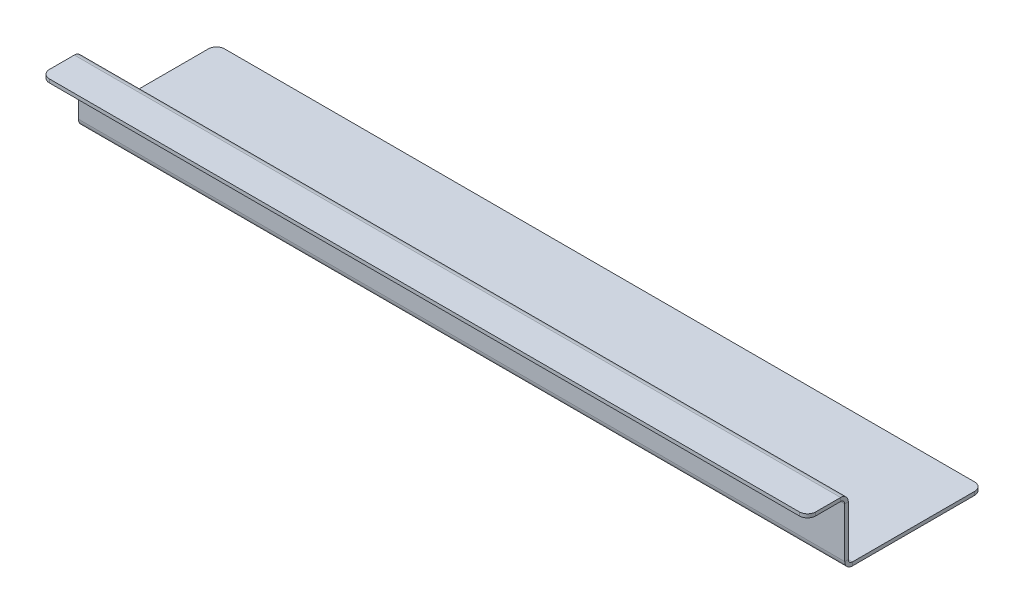
ISO-10303-21;
HEADER;
FILE_DESCRIPTION(('STEP AP214'),'2;1');
FILE_NAME('part.step','',(''),(''),'','','');
FILE_SCHEMA(('AUTOMOTIVE_DESIGN { 1 0 10303 214 1 1 1 1 }'));
ENDSEC;
DATA;
#1=APPLICATION_CONTEXT('core data for automotive mechanical design processes');
#2=APPLICATION_PROTOCOL_DEFINITION('international standard','automotive_design',2000,#1);
#3=PRODUCT_CONTEXT('',#1,'mechanical');
#4=PRODUCT('Part','Part','',(#3));
#5=PRODUCT_RELATED_PRODUCT_CATEGORY('part','',(#4));
#6=PRODUCT_DEFINITION_FORMATION('','',#4);
#7=PRODUCT_DEFINITION_CONTEXT('part definition',#1,'design');
#8=PRODUCT_DEFINITION('design','',#6,#7);
#9=PRODUCT_DEFINITION_SHAPE('','',#8);
#10=(LENGTH_UNIT() NAMED_UNIT(*) SI_UNIT(.MILLI.,.METRE.));
#11=(NAMED_UNIT(*) PLANE_ANGLE_UNIT() SI_UNIT($,.RADIAN.));
#12=(NAMED_UNIT(*) SI_UNIT($,.STERADIAN.) SOLID_ANGLE_UNIT());
#13=UNCERTAINTY_MEASURE_WITH_UNIT(LENGTH_MEASURE(1.E-05),#10,'distance_accuracy_value','');
#14=(GEOMETRIC_REPRESENTATION_CONTEXT(3) GLOBAL_UNCERTAINTY_ASSIGNED_CONTEXT((#13)) GLOBAL_UNIT_ASSIGNED_CONTEXT((#10,
#11,#12)) REPRESENTATION_CONTEXT('',''));
#15=CARTESIAN_POINT('',(0.,0.,0.));
#16=DIRECTION('',(0.,0.,1.));
#17=DIRECTION('',(1.,0.,0.));
#18=AXIS2_PLACEMENT_3D('',#15,#16,#17);
#19=CARTESIAN_POINT('',(596.9,-50.8,-31.7500000000002));
#20=DIRECTION('',(-1.,0.,0.));
#21=DIRECTION('',(0.,0.,1.));
#22=AXIS2_PLACEMENT_3D('',#19,#20,#21);
#23=PLANE('',#22);
#24=DIRECTION('',(0.,0.,1.));
#25=VECTOR('',#24,1.);
#26=CARTESIAN_POINT('',(596.9,-44.87164,-31.7500000000001));
#27=LINE('',#26,#25);
#28=CARTESIAN_POINT('',(596.9,-44.87164,-31.7500000000001));
#29=VERTEX_POINT('',#28);
#30=CARTESIAN_POINT('',(596.9,-44.87164,-28.9966400000001));
#31=VERTEX_POINT('',#30);
#32=EDGE_CURVE('E249',#29,#31,#27,.T.);
#33=ORIENTED_EDGE('',*,*,#32,.F.);
#34=DIRECTION('',(0.,-1.,0.));
#35=VECTOR('',#34,1.);
#36=CARTESIAN_POINT('',(596.9,1.19661315799875E-13,-31.75));
#37=LINE('',#36,#35);
#38=CARTESIAN_POINT('',(596.9,-5.92835999999999,-31.75));
#39=VERTEX_POINT('',#38);
#40=EDGE_CURVE('E257',#39,#29,#37,.T.);
#41=ORIENTED_EDGE('',*,*,#40,.F.);
#42=DIRECTION('',(0.,0.,1.));
#43=VECTOR('',#42,1.);
#44=CARTESIAN_POINT('',(596.9,-5.92836000000001,-28.99664));
#45=LINE('',#44,#43);
#46=CARTESIAN_POINT('',(596.9,-5.92836000000005,-28.99664));
#47=VERTEX_POINT('',#46);
#48=EDGE_CURVE('E268',#47,#39,#45,.F.);
#49=ORIENTED_EDGE('',*,*,#48,.F.);
#50=DIRECTION('',(0.,1.,0.));
#51=VECTOR('',#50,1.);
#52=CARTESIAN_POINT('',(596.9,-50.8,-28.9966400000002));
#53=LINE('',#52,#51);
#54=EDGE_CURVE('E262',#47,#31,#53,.F.);
#55=ORIENTED_EDGE('',*,*,#54,.T.);
#56=EDGE_LOOP('',(#33,#41,#49,#55));
#57=FACE_BOUND('',#56,.T.);
#58=ADVANCED_FACE('F80',(#57),#23,.F.);
#59=CARTESIAN_POINT('',(0.,-2.75335999999999,-31.75));
#60=DIRECTION('',(1.,0.,0.));
#61=DIRECTION('',(0.,0.,-1.));
#62=AXIS2_PLACEMENT_3D('',#59,#60,#61);
#63=PLANE('',#62);
#64=DIRECTION('',(0.,0.,1.));
#65=VECTOR('',#64,1.);
#66=CARTESIAN_POINT('',(0.,-44.87164,-31.7500000000001));
#67=LINE('',#66,#65);
#68=CARTESIAN_POINT('',(0.,-44.87164,-31.7500000000001));
#69=VERTEX_POINT('',#68);
#70=CARTESIAN_POINT('',(0.,-44.87164,-28.9966400000001));
#71=VERTEX_POINT('',#70);
#72=EDGE_CURVE('E242',#69,#71,#67,.T.);
#73=ORIENTED_EDGE('',*,*,#72,.T.);
#74=DIRECTION('',(0.,-1.,0.));
#75=VECTOR('',#74,1.);
#76=CARTESIAN_POINT('',(0.,-2.75336,-28.99664));
#77=LINE('',#76,#75);
#78=CARTESIAN_POINT('',(0.,-5.92835999999997,-28.99664));
#79=VERTEX_POINT('',#78);
#80=EDGE_CURVE('E260',#71,#79,#77,.F.);
#81=ORIENTED_EDGE('',*,*,#80,.T.);
#82=DIRECTION('',(0.,0.,1.));
#83=VECTOR('',#82,1.);
#84=CARTESIAN_POINT('',(0.,-5.92835999999997,-31.75));
#85=LINE('',#84,#83);
#86=CARTESIAN_POINT('',(0.,-5.92835999999996,-31.75));
#87=VERTEX_POINT('',#86);
#88=EDGE_CURVE('E252',#79,#87,#85,.F.);
#89=ORIENTED_EDGE('',*,*,#88,.T.);
#90=DIRECTION('',(0.,1.,0.));
#91=VECTOR('',#90,1.);
#92=CARTESIAN_POINT('',(0.,1.19661315799875E-13,-31.75));
#93=LINE('',#92,#91);
#94=EDGE_CURVE('E254',#69,#87,#93,.T.);
#95=ORIENTED_EDGE('',*,*,#94,.F.);
#96=EDGE_LOOP('',(#73,#81,#89,#95));
#97=FACE_BOUND('',#96,.T.);
#98=ADVANCED_FACE('F382',(#97),#63,.F.);
#99=CARTESIAN_POINT('',(0.,1.19661315799875E-13,-31.75));
#100=DIRECTION('',(0.,0.,1.));
#101=DIRECTION('',(0.,-1.,0.));
#102=AXIS2_PLACEMENT_3D('',#99,#100,#101);
#103=PLANE('',#102);
#104=DIRECTION('',(-1.,0.,0.));
#105=VECTOR('',#104,1.);
#106=CARTESIAN_POINT('',(0.,-44.87164,-31.7500000000001));
#107=LINE('',#106,#105);
#108=EDGE_CURVE('E246',#69,#29,#107,.F.);
#109=ORIENTED_EDGE('',*,*,#108,.F.);
#110=ORIENTED_EDGE('',*,*,#94,.T.);
#111=DIRECTION('',(1.,0.,0.));
#112=VECTOR('',#111,1.);
#113=CARTESIAN_POINT('',(0.,-5.92835999999997,-31.75));
#114=LINE('',#113,#112);
#115=EDGE_CURVE('E265',#39,#87,#114,.F.);
#116=ORIENTED_EDGE('',*,*,#115,.F.);
#117=ORIENTED_EDGE('',*,*,#40,.T.);
#118=EDGE_LOOP('',(#109,#110,#116,#117));
#119=FACE_BOUND('',#118,.T.);
#120=ADVANCED_FACE('F371',(#119),#103,.F.);
#121=CARTESIAN_POINT('',(0.,1.10048010740757E-13,-28.99664));
#122=DIRECTION('',(0.,0.,1.));
#123=DIRECTION('',(0.,-1.,0.));
#124=AXIS2_PLACEMENT_3D('',#121,#122,#123);
#125=PLANE('',#124);
#126=ORIENTED_EDGE('',*,*,#80,.F.);
#127=DIRECTION('',(-1.,0.,0.));
#128=VECTOR('',#127,1.);
#129=CARTESIAN_POINT('',(0.,-44.87164,-28.9966400000001));
#130=LINE('',#129,#128);
#131=EDGE_CURVE('E203',#71,#31,#130,.F.);
#132=ORIENTED_EDGE('',*,*,#131,.T.);
#133=ORIENTED_EDGE('',*,*,#54,.F.);
#134=DIRECTION('',(1.,0.,0.));
#135=VECTOR('',#134,1.);
#136=CARTESIAN_POINT('',(0.,-5.92835999999999,-28.99664));
#137=LINE('',#136,#135);
#138=EDGE_CURVE('E271',#79,#47,#137,.T.);
#139=ORIENTED_EDGE('',*,*,#138,.F.);
#140=EDGE_LOOP('',(#126,#132,#133,#139));
#141=FACE_BOUND('',#140,.T.);
#142=ADVANCED_FACE('F386',(#141),#125,.T.);
#143=CARTESIAN_POINT('',(596.9,-2.75336,0.));
#144=DIRECTION('',(1.,0.,0.));
#145=DIRECTION('',(0.,0.,-1.));
#146=AXIS2_PLACEMENT_3D('',#143,#144,#145);
#147=PLANE('',#146);
#148=DIRECTION('',(0.,0.,-1.));
#149=VECTOR('',#148,1.);
#150=CARTESIAN_POINT('',(596.9,0.,0.));
#151=LINE('',#150,#149);
#152=CARTESIAN_POINT('',(596.9,0.,-6.35));
#153=VERTEX_POINT('',#152);
#154=CARTESIAN_POINT('',(596.9,0.,-25.82164));
#155=VERTEX_POINT('',#154);
#156=EDGE_CURVE('E302',#153,#155,#151,.T.);
#157=ORIENTED_EDGE('',*,*,#156,.F.);
#158=DIRECTION('',(0.,1.,0.));
#159=VECTOR('',#158,1.);
#160=CARTESIAN_POINT('',(596.9,-2.75336,-6.35));
#161=LINE('',#160,#159);
#162=CARTESIAN_POINT('',(596.9,-2.75336,-6.35));
#163=VERTEX_POINT('',#162);
#164=EDGE_CURVE('E322',#153,#163,#161,.F.);
#165=ORIENTED_EDGE('',*,*,#164,.T.);
#166=DIRECTION('',(0.,0.,-1.));
#167=VECTOR('',#166,1.);
#168=CARTESIAN_POINT('',(596.9,-2.75336,0.));
#169=LINE('',#168,#167);
#170=CARTESIAN_POINT('',(596.9,-2.75336,-25.82164));
#171=VERTEX_POINT('',#170);
#172=EDGE_CURVE('E305',#163,#171,#169,.T.);
#173=ORIENTED_EDGE('',*,*,#172,.T.);
#174=DIRECTION('',(0.,1.,0.));
#175=VECTOR('',#174,1.);
#176=CARTESIAN_POINT('',(596.9,-2.75336000000006,-25.82164));
#177=LINE('',#176,#175);
#178=EDGE_CURVE('E281',#171,#155,#177,.T.);
#179=ORIENTED_EDGE('',*,*,#178,.T.);
#180=EDGE_LOOP('',(#157,#165,#173,#179));
#181=FACE_BOUND('',#180,.T.);
#182=ADVANCED_FACE('F395',(#181),#147,.T.);
#183=CARTESIAN_POINT('',(0.,-2.75336,0.));
#184=DIRECTION('',(0.,-1.,0.));
#185=DIRECTION('',(0.,0.,-1.));
#186=AXIS2_PLACEMENT_3D('',#183,#184,#185);
#187=PLANE('',#186);
#188=ORIENTED_EDGE('',*,*,#172,.F.);
#189=CARTESIAN_POINT('',(590.55,-2.75336,-6.35));
#190=DIRECTION('',(0.,-1.,0.));
#191=DIRECTION('',(0.,0.,-1.));
#192=AXIS2_PLACEMENT_3D('',#189,#190,#191);
#193=CIRCLE('',#192,6.35);
#194=CARTESIAN_POINT('',(590.55,-2.75336,0.));
#195=VERTEX_POINT('',#194);
#196=EDGE_CURVE('E326',#163,#195,#193,.T.);
#197=ORIENTED_EDGE('',*,*,#196,.T.);
#198=DIRECTION('',(1.,0.,0.));
#199=VECTOR('',#198,1.);
#200=CARTESIAN_POINT('',(0.,-2.75336,0.));
#201=LINE('',#200,#199);
#202=CARTESIAN_POINT('',(6.35,-2.75336,0.));
#203=VERTEX_POINT('',#202);
#204=EDGE_CURVE('E301',#203,#195,#201,.T.);
#205=ORIENTED_EDGE('',*,*,#204,.F.);
#206=CARTESIAN_POINT('',(6.35,-2.75336,-6.35));
#207=DIRECTION('',(0.,-1.,0.));
#208=DIRECTION('',(0.,0.,-1.));
#209=AXIS2_PLACEMENT_3D('',#206,#207,#208);
#210=CIRCLE('',#209,6.35);
#211=CARTESIAN_POINT('',(0.,-2.75336,-6.35));
#212=VERTEX_POINT('',#211);
#213=EDGE_CURVE('E324',#203,#212,#210,.T.);
#214=ORIENTED_EDGE('',*,*,#213,.T.);
#215=DIRECTION('',(0.,0.,1.));
#216=VECTOR('',#215,1.);
#217=CARTESIAN_POINT('',(0.,-2.75336,0.));
#218=LINE('',#217,#216);
#219=CARTESIAN_POINT('',(0.,-2.75336,-25.82164));
#220=VERTEX_POINT('',#219);
#221=EDGE_CURVE('E298',#220,#212,#218,.T.);
#222=ORIENTED_EDGE('',*,*,#221,.F.);
#223=DIRECTION('',(1.,0.,0.));
#224=VECTOR('',#223,1.);
#225=CARTESIAN_POINT('',(596.9,-2.75336000000006,-25.82164));
#226=LINE('',#225,#224);
#227=EDGE_CURVE('E287',#171,#220,#226,.F.);
#228=ORIENTED_EDGE('',*,*,#227,.F.);
#229=EDGE_LOOP('',(#188,#197,#205,#214,#222,#228));
#230=FACE_BOUND('',#229,.T.);
#231=ADVANCED_FACE('F418',(#230),#187,.T.);
#232=CARTESIAN_POINT('',(0.,0.,0.));
#233=DIRECTION('',(0.,-1.,0.));
#234=DIRECTION('',(0.,0.,-1.));
#235=AXIS2_PLACEMENT_3D('',#232,#233,#234);
#236=PLANE('',#235);
#237=DIRECTION('',(1.,0.,0.));
#238=VECTOR('',#237,1.);
#239=CARTESIAN_POINT('',(0.,0.,0.));
#240=LINE('',#239,#238);
#241=CARTESIAN_POINT('',(6.35,0.,0.));
#242=VERTEX_POINT('',#241);
#243=CARTESIAN_POINT('',(590.55,0.,0.));
#244=VERTEX_POINT('',#243);
#245=EDGE_CURVE('E310',#242,#244,#240,.T.);
#246=ORIENTED_EDGE('',*,*,#245,.T.);
#247=CARTESIAN_POINT('',(590.55,0.,-6.35));
#248=DIRECTION('',(0.,-1.,0.));
#249=DIRECTION('',(0.,0.,-1.));
#250=AXIS2_PLACEMENT_3D('',#247,#248,#249);
#251=CIRCLE('',#250,6.35);
#252=EDGE_CURVE('E320',#244,#153,#251,.F.);
#253=ORIENTED_EDGE('',*,*,#252,.T.);
#254=ORIENTED_EDGE('',*,*,#156,.T.);
#255=DIRECTION('',(1.,0.,0.));
#256=VECTOR('',#255,1.);
#257=CARTESIAN_POINT('',(596.9,0.,-25.82164));
#258=LINE('',#257,#256);
#259=CARTESIAN_POINT('',(0.,0.,-25.82164));
#260=VERTEX_POINT('',#259);
#261=EDGE_CURVE('E275',#155,#260,#258,.F.);
#262=ORIENTED_EDGE('',*,*,#261,.T.);
#263=DIRECTION('',(0.,0.,1.));
#264=VECTOR('',#263,1.);
#265=CARTESIAN_POINT('',(0.,0.,0.));
#266=LINE('',#265,#264);
#267=CARTESIAN_POINT('',(0.,0.,-6.35));
#268=VERTEX_POINT('',#267);
#269=EDGE_CURVE('E295',#260,#268,#266,.T.);
#270=ORIENTED_EDGE('',*,*,#269,.T.);
#271=CARTESIAN_POINT('',(6.35,0.,-6.35));
#272=DIRECTION('',(0.,-1.,0.));
#273=DIRECTION('',(0.,0.,-1.));
#274=AXIS2_PLACEMENT_3D('',#271,#272,#273);
#275=CIRCLE('',#274,6.35);
#276=EDGE_CURVE('E318',#268,#242,#275,.F.);
#277=ORIENTED_EDGE('',*,*,#276,.T.);
#278=EDGE_LOOP('',(#246,#253,#254,#262,#270,#277));
#279=FACE_BOUND('',#278,.T.);
#280=ADVANCED_FACE('F401',(#279),#236,.F.);
#281=CARTESIAN_POINT('',(0.,-2.75336,0.));
#282=DIRECTION('',(-1.,0.,0.));
#283=DIRECTION('',(0.,0.,1.));
#284=AXIS2_PLACEMENT_3D('',#281,#282,#283);
#285=PLANE('',#284);
#286=ORIENTED_EDGE('',*,*,#221,.T.);
#287=DIRECTION('',(0.,1.,0.));
#288=VECTOR('',#287,1.);
#289=CARTESIAN_POINT('',(0.,-2.75336,-6.35));
#290=LINE('',#289,#288);
#291=EDGE_CURVE('E13',#212,#268,#290,.T.);
#292=ORIENTED_EDGE('',*,*,#291,.T.);
#293=ORIENTED_EDGE('',*,*,#269,.F.);
#294=DIRECTION('',(0.,1.,0.));
#295=VECTOR('',#294,1.);
#296=CARTESIAN_POINT('',(0.,-2.75335999999998,-25.82164));
#297=LINE('',#296,#295);
#298=EDGE_CURVE('E292',#220,#260,#297,.T.);
#299=ORIENTED_EDGE('',*,*,#298,.F.);
#300=EDGE_LOOP('',(#286,#292,#293,#299));
#301=FACE_BOUND('',#300,.T.);
#302=ADVANCED_FACE('F403',(#301),#285,.T.);
#303=CARTESIAN_POINT('',(0.,-2.75336,0.));
#304=DIRECTION('',(0.,0.,1.));
#305=DIRECTION('',(1.,0.,0.));
#306=AXIS2_PLACEMENT_3D('',#303,#304,#305);
#307=PLANE('',#306);
#308=ORIENTED_EDGE('',*,*,#204,.T.);
#309=DIRECTION('',(0.,1.,0.));
#310=VECTOR('',#309,1.);
#311=CARTESIAN_POINT('',(590.55,-2.75336,0.));
#312=LINE('',#311,#310);
#313=EDGE_CURVE('E315',#195,#244,#312,.T.);
#314=ORIENTED_EDGE('',*,*,#313,.T.);
#315=ORIENTED_EDGE('',*,*,#245,.F.);
#316=DIRECTION('',(0.,1.,0.));
#317=VECTOR('',#316,1.);
#318=CARTESIAN_POINT('',(6.35,-2.75336,0.));
#319=LINE('',#318,#317);
#320=EDGE_CURVE('E307',#242,#203,#319,.F.);
#321=ORIENTED_EDGE('',*,*,#320,.T.);
#322=EDGE_LOOP('',(#308,#314,#315,#321));
#323=FACE_BOUND('',#322,.T.);
#324=ADVANCED_FACE('F411',(#323),#307,.T.);
#325=CARTESIAN_POINT('',(0.,-5.92835999999998,-25.82164));
#326=DIRECTION('',(-1.,0.,0.));
#327=DIRECTION('',(0.,-1.,0.));
#328=AXIS2_PLACEMENT_3D('',#325,#326,#327);
#329=PLANE('',#328);
#330=ORIENTED_EDGE('',*,*,#88,.F.);
#331=CARTESIAN_POINT('',(0.,-5.92835999999998,-25.82164));
#332=DIRECTION('',(1.,0.,0.));
#333=DIRECTION('',(0.,1.,0.));
#334=AXIS2_PLACEMENT_3D('',#331,#332,#333);
#335=CIRCLE('',#334,3.175);
#336=EDGE_CURVE('E284',#220,#79,#335,.F.);
#337=ORIENTED_EDGE('',*,*,#336,.F.);
#338=ORIENTED_EDGE('',*,*,#298,.T.);
#339=CARTESIAN_POINT('',(0.,-5.92835999999998,-25.82164));
#340=DIRECTION('',(1.,0.,0.));
#341=DIRECTION('',(0.,1.,0.));
#342=AXIS2_PLACEMENT_3D('',#339,#340,#341);
#343=CIRCLE('',#342,5.92836);
#344=EDGE_CURVE('E277',#260,#87,#343,.F.);
#345=ORIENTED_EDGE('',*,*,#344,.T.);
#346=EDGE_LOOP('',(#330,#337,#338,#345));
#347=FACE_BOUND('',#346,.T.);
#348=ADVANCED_FACE('F379',(#347),#329,.T.);
#349=CARTESIAN_POINT('',(596.9,-5.92836000000006,-25.82164));
#350=DIRECTION('',(-1.,0.,0.));
#351=DIRECTION('',(0.,-1.,0.));
#352=AXIS2_PLACEMENT_3D('',#349,#350,#351);
#353=PLANE('',#352);
#354=CARTESIAN_POINT('',(596.9,-5.92836000000006,-25.82164));
#355=DIRECTION('',(1.,0.,0.));
#356=DIRECTION('',(0.,1.,0.));
#357=AXIS2_PLACEMENT_3D('',#354,#355,#356);
#358=CIRCLE('',#357,3.175);
#359=EDGE_CURVE('E256',#47,#171,#358,.T.);
#360=ORIENTED_EDGE('',*,*,#359,.F.);
#361=ORIENTED_EDGE('',*,*,#48,.T.);
#362=CARTESIAN_POINT('',(596.9,-5.92836000000006,-25.82164));
#363=DIRECTION('',(1.,0.,0.));
#364=DIRECTION('',(0.,1.,0.));
#365=AXIS2_PLACEMENT_3D('',#362,#363,#364);
#366=CIRCLE('',#365,5.92836);
#367=EDGE_CURVE('E278',#39,#155,#366,.T.);
#368=ORIENTED_EDGE('',*,*,#367,.T.);
#369=ORIENTED_EDGE('',*,*,#178,.F.);
#370=EDGE_LOOP('',(#360,#361,#368,#369));
#371=FACE_BOUND('',#370,.T.);
#372=ADVANCED_FACE('F392',(#371),#353,.F.);
#373=CARTESIAN_POINT('',(596.9,-5.92836000000006,-25.82164));
#374=DIRECTION('',(1.,0.,0.));
#375=DIRECTION('',(0.,0.,-1.));
#376=AXIS2_PLACEMENT_3D('',#373,#374,#375);
#377=CYLINDRICAL_SURFACE('',#376,5.92836);
#378=ORIENTED_EDGE('',*,*,#261,.F.);
#379=ORIENTED_EDGE('',*,*,#367,.F.);
#380=ORIENTED_EDGE('',*,*,#115,.T.);
#381=ORIENTED_EDGE('',*,*,#344,.F.);
#382=EDGE_LOOP('',(#378,#379,#380,#381));
#383=FACE_BOUND('',#382,.T.);
#384=ADVANCED_FACE('F376',(#383),#377,.T.);
#385=CARTESIAN_POINT('',(596.9,-5.92836000000006,-25.82164));
#386=DIRECTION('',(1.,0.,0.));
#387=DIRECTION('',(0.,0.,-1.));
#388=AXIS2_PLACEMENT_3D('',#385,#386,#387);
#389=CYLINDRICAL_SURFACE('',#388,3.175);
#390=ORIENTED_EDGE('',*,*,#227,.T.);
#391=ORIENTED_EDGE('',*,*,#336,.T.);
#392=ORIENTED_EDGE('',*,*,#138,.T.);
#393=ORIENTED_EDGE('',*,*,#359,.T.);
#394=EDGE_LOOP('',(#390,#391,#392,#393));
#395=FACE_BOUND('',#394,.T.);
#396=ADVANCED_FACE('F389',(#395),#389,.F.);
#397=CARTESIAN_POINT('',(596.9,-44.87164,-34.9250000000002));
#398=DIRECTION('',(1.,0.,0.));
#399=DIRECTION('',(0.,0.,-1.));
#400=AXIS2_PLACEMENT_3D('',#397,#398,#399);
#401=PLANE('',#400);
#402=DIRECTION('',(0.,1.,0.));
#403=VECTOR('',#402,1.);
#404=CARTESIAN_POINT('',(596.9,-50.8,-34.9250000000002));
#405=LINE('',#404,#403);
#406=CARTESIAN_POINT('',(596.9,-48.04664,-34.9250000000002));
#407=VERTEX_POINT('',#406);
#408=CARTESIAN_POINT('',(596.9,-50.8,-34.9250000000002));
#409=VERTEX_POINT('',#408);
#410=EDGE_CURVE('E237',#407,#409,#405,.F.);
#411=ORIENTED_EDGE('',*,*,#410,.F.);
#412=CARTESIAN_POINT('',(596.9,-44.87164,-34.9250000000002));
#413=DIRECTION('',(-1.,0.,0.));
#414=DIRECTION('',(0.,0.,1.));
#415=AXIS2_PLACEMENT_3D('',#412,#413,#414);
#416=CIRCLE('',#415,3.175);
#417=EDGE_CURVE('E206',#29,#407,#416,.F.);
#418=ORIENTED_EDGE('',*,*,#417,.F.);
#419=ORIENTED_EDGE('',*,*,#32,.T.);
#420=CARTESIAN_POINT('',(596.9,-44.87164,-34.9250000000002));
#421=DIRECTION('',(-1.,0.,0.));
#422=DIRECTION('',(0.,0.,1.));
#423=AXIS2_PLACEMENT_3D('',#420,#421,#422);
#424=CIRCLE('',#423,5.92836);
#425=EDGE_CURVE('E241',#31,#409,#424,.F.);
#426=ORIENTED_EDGE('',*,*,#425,.T.);
#427=EDGE_LOOP('',(#411,#418,#419,#426));
#428=FACE_BOUND('',#427,.T.);
#429=ADVANCED_FACE('F364',(#428),#401,.T.);
#430=CARTESIAN_POINT('',(0.,-44.87164,-34.9250000000002));
#431=DIRECTION('',(1.,0.,0.));
#432=DIRECTION('',(0.,0.,-1.));
#433=AXIS2_PLACEMENT_3D('',#430,#431,#432);
#434=PLANE('',#433);
#435=CARTESIAN_POINT('',(0.,-44.87164,-34.9250000000002));
#436=DIRECTION('',(-1.,0.,0.));
#437=DIRECTION('',(0.,0.,1.));
#438=AXIS2_PLACEMENT_3D('',#435,#436,#437);
#439=CIRCLE('',#438,3.175);
#440=CARTESIAN_POINT('',(0.,-48.04664,-34.9250000000002));
#441=VERTEX_POINT('',#440);
#442=EDGE_CURVE('E213',#441,#69,#439,.T.);
#443=ORIENTED_EDGE('',*,*,#442,.F.);
#444=DIRECTION('',(0.,1.,0.));
#445=VECTOR('',#444,1.);
#446=CARTESIAN_POINT('',(0.,-48.04664,-34.9250000000001));
#447=LINE('',#446,#445);
#448=CARTESIAN_POINT('',(0.,-50.8,-34.9250000000001));
#449=VERTEX_POINT('',#448);
#450=EDGE_CURVE('E210',#441,#449,#447,.F.);
#451=ORIENTED_EDGE('',*,*,#450,.T.);
#452=CARTESIAN_POINT('',(0.,-44.87164,-34.9250000000002));
#453=DIRECTION('',(-1.,0.,0.));
#454=DIRECTION('',(0.,0.,1.));
#455=AXIS2_PLACEMENT_3D('',#452,#453,#454);
#456=CIRCLE('',#455,5.92836);
#457=EDGE_CURVE('E196',#449,#71,#456,.T.);
#458=ORIENTED_EDGE('',*,*,#457,.T.);
#459=ORIENTED_EDGE('',*,*,#72,.F.);
#460=EDGE_LOOP('',(#443,#451,#458,#459));
#461=FACE_BOUND('',#460,.T.);
#462=ADVANCED_FACE('F211',(#461),#434,.F.);
#463=CARTESIAN_POINT('',(0.,-44.87164,-34.9250000000002));
#464=DIRECTION('',(-1.,0.,0.));
#465=DIRECTION('',(0.,-1.,0.));
#466=AXIS2_PLACEMENT_3D('',#463,#464,#465);
#467=CYLINDRICAL_SURFACE('',#466,5.92836);
#468=ORIENTED_EDGE('',*,*,#131,.F.);
#469=ORIENTED_EDGE('',*,*,#457,.F.);
#470=DIRECTION('',(-1.,0.,0.));
#471=VECTOR('',#470,1.);
#472=CARTESIAN_POINT('',(596.9,-50.8,-34.9250000000002));
#473=LINE('',#472,#471);
#474=EDGE_CURVE('E200',#449,#409,#473,.F.);
#475=ORIENTED_EDGE('',*,*,#474,.T.);
#476=ORIENTED_EDGE('',*,*,#425,.F.);
#477=EDGE_LOOP('',(#468,#469,#475,#476));
#478=FACE_BOUND('',#477,.T.);
#479=ADVANCED_FACE('F198',(#478),#467,.T.);
#480=CARTESIAN_POINT('',(0.,-44.87164,-34.9250000000002));
#481=DIRECTION('',(-1.,0.,0.));
#482=DIRECTION('',(0.,-1.,0.));
#483=AXIS2_PLACEMENT_3D('',#480,#481,#482);
#484=CYLINDRICAL_SURFACE('',#483,3.175);
#485=ORIENTED_EDGE('',*,*,#108,.T.);
#486=ORIENTED_EDGE('',*,*,#417,.T.);
#487=DIRECTION('',(-1.,0.,0.));
#488=VECTOR('',#487,1.);
#489=CARTESIAN_POINT('',(596.9,-48.04664,-34.9250000000002));
#490=LINE('',#489,#488);
#491=EDGE_CURVE('E215',#407,#441,#490,.T.);
#492=ORIENTED_EDGE('',*,*,#491,.T.);
#493=ORIENTED_EDGE('',*,*,#442,.T.);
#494=EDGE_LOOP('',(#485,#486,#492,#493));
#495=FACE_BOUND('',#494,.T.);
#496=ADVANCED_FACE('F359',(#495),#484,.F.);
#497=CARTESIAN_POINT('',(596.9,-50.8,-31.7500000000002));
#498=DIRECTION('',(-1.,0.,0.));
#499=DIRECTION('',(0.,0.,1.));
#500=AXIS2_PLACEMENT_3D('',#497,#498,#499);
#501=PLANE('',#500);
#502=DIRECTION('',(0.,0.,1.));
#503=VECTOR('',#502,1.);
#504=CARTESIAN_POINT('',(596.9,-50.8,0.));
#505=LINE('',#504,#503);
#506=CARTESIAN_POINT('',(596.9,-50.8,-130.175));
#507=VERTEX_POINT('',#506);
#508=EDGE_CURVE('E222',#507,#409,#505,.T.);
#509=ORIENTED_EDGE('',*,*,#508,.F.);
#510=DIRECTION('',(0.,1.,0.));
#511=VECTOR('',#510,1.);
#512=CARTESIAN_POINT('',(596.9,-50.8,-130.175));
#513=LINE('',#512,#511);
#514=CARTESIAN_POINT('',(596.9,-48.04664,-130.175));
#515=VERTEX_POINT('',#514);
#516=EDGE_CURVE('E328',#507,#515,#513,.T.);
#517=ORIENTED_EDGE('',*,*,#516,.T.);
#518=DIRECTION('',(0.,0.,-1.));
#519=VECTOR('',#518,1.);
#520=CARTESIAN_POINT('',(596.9,-48.04664,-31.7500000000002));
#521=LINE('',#520,#519);
#522=EDGE_CURVE('E223',#515,#407,#521,.F.);
#523=ORIENTED_EDGE('',*,*,#522,.T.);
#524=ORIENTED_EDGE('',*,*,#410,.T.);
#525=EDGE_LOOP('',(#509,#517,#523,#524));
#526=FACE_BOUND('',#525,.T.);
#527=ADVANCED_FACE('F346',(#526),#501,.F.);
#528=CARTESIAN_POINT('',(0.,-50.8,-136.525));
#529=DIRECTION('',(1.,0.,0.));
#530=DIRECTION('',(0.,0.,-1.));
#531=AXIS2_PLACEMENT_3D('',#528,#529,#530);
#532=PLANE('',#531);
#533=DIRECTION('',(0.,0.,1.));
#534=VECTOR('',#533,1.);
#535=CARTESIAN_POINT('',(0.,-48.04664,-136.525));
#536=LINE('',#535,#534);
#537=CARTESIAN_POINT('',(0.,-48.04664,-130.175));
#538=VERTEX_POINT('',#537);
#539=EDGE_CURVE('E233',#441,#538,#536,.F.);
#540=ORIENTED_EDGE('',*,*,#539,.T.);
#541=DIRECTION('',(0.,1.,0.));
#542=VECTOR('',#541,1.);
#543=CARTESIAN_POINT('',(0.,-50.8,-130.175));
#544=LINE('',#543,#542);
#545=CARTESIAN_POINT('',(0.,-50.8,-130.175));
#546=VERTEX_POINT('',#545);
#547=EDGE_CURVE('E88',#538,#546,#544,.F.);
#548=ORIENTED_EDGE('',*,*,#547,.T.);
#549=DIRECTION('',(0.,0.,-1.));
#550=VECTOR('',#549,1.);
#551=CARTESIAN_POINT('',(0.,-50.8,0.));
#552=LINE('',#551,#550);
#553=EDGE_CURVE('E219',#449,#546,#552,.T.);
#554=ORIENTED_EDGE('',*,*,#553,.F.);
#555=ORIENTED_EDGE('',*,*,#450,.F.);
#556=EDGE_LOOP('',(#540,#548,#554,#555));
#557=FACE_BOUND('',#556,.T.);
#558=ADVANCED_FACE('F225',(#557),#532,.F.);
#559=CARTESIAN_POINT('',(0.,-50.8,0.));
#560=DIRECTION('',(0.,1.,0.));
#561=DIRECTION('',(0.,0.,1.));
#562=AXIS2_PLACEMENT_3D('',#559,#560,#561);
#563=PLANE('',#562);
#564=DIRECTION('',(1.,0.,0.));
#565=VECTOR('',#564,1.);
#566=CARTESIAN_POINT('',(0.,-50.8,-136.525));
#567=LINE('',#566,#565);
#568=CARTESIAN_POINT('',(6.34999999999997,-50.8,-136.525));
#569=VERTEX_POINT('',#568);
#570=CARTESIAN_POINT('',(590.55,-50.8,-136.525));
#571=VERTEX_POINT('',#570);
#572=EDGE_CURVE('E226',#569,#571,#567,.T.);
#573=ORIENTED_EDGE('',*,*,#572,.T.);
#574=CARTESIAN_POINT('',(590.55,-50.8,-130.175));
#575=DIRECTION('',(0.,1.,0.));
#576=DIRECTION('',(0.,0.,1.));
#577=AXIS2_PLACEMENT_3D('',#574,#575,#576);
#578=CIRCLE('',#577,6.35);
#579=EDGE_CURVE('E341',#571,#507,#578,.F.);
#580=ORIENTED_EDGE('',*,*,#579,.T.);
#581=ORIENTED_EDGE('',*,*,#508,.T.);
#582=ORIENTED_EDGE('',*,*,#474,.F.);
#583=ORIENTED_EDGE('',*,*,#553,.T.);
#584=CARTESIAN_POINT('',(6.34999999999997,-50.8,-130.175));
#585=DIRECTION('',(0.,1.,0.));
#586=DIRECTION('',(0.,0.,1.));
#587=AXIS2_PLACEMENT_3D('',#584,#585,#586);
#588=CIRCLE('',#587,6.35);
#589=EDGE_CURVE('E339',#546,#569,#588,.F.);
#590=ORIENTED_EDGE('',*,*,#589,.T.);
#591=EDGE_LOOP('',(#573,#580,#581,#582,#583,#590));
#592=FACE_BOUND('',#591,.T.);
#593=ADVANCED_FACE('F218',(#592),#563,.F.);
#594=CARTESIAN_POINT('',(0.,-48.04664,0.));
#595=DIRECTION('',(0.,1.,0.));
#596=DIRECTION('',(0.,0.,1.));
#597=AXIS2_PLACEMENT_3D('',#594,#595,#596);
#598=PLANE('',#597);
#599=ORIENTED_EDGE('',*,*,#522,.F.);
#600=CARTESIAN_POINT('',(590.55,-48.04664,-130.175));
#601=DIRECTION('',(0.,1.,0.));
#602=DIRECTION('',(0.,0.,1.));
#603=AXIS2_PLACEMENT_3D('',#600,#601,#602);
#604=CIRCLE('',#603,6.35);
#605=CARTESIAN_POINT('',(590.55,-48.04664,-136.525));
#606=VERTEX_POINT('',#605);
#607=EDGE_CURVE('E333',#515,#606,#604,.T.);
#608=ORIENTED_EDGE('',*,*,#607,.T.);
#609=DIRECTION('',(-1.,0.,0.));
#610=VECTOR('',#609,1.);
#611=CARTESIAN_POINT('',(596.9,-48.04664,-136.525));
#612=LINE('',#611,#610);
#613=CARTESIAN_POINT('',(6.34999999999997,-48.04664,-136.525));
#614=VERTEX_POINT('',#613);
#615=EDGE_CURVE('E229',#614,#606,#612,.F.);
#616=ORIENTED_EDGE('',*,*,#615,.F.);
#617=CARTESIAN_POINT('',(6.34999999999997,-48.04664,-130.175));
#618=DIRECTION('',(0.,1.,0.));
#619=DIRECTION('',(0.,0.,1.));
#620=AXIS2_PLACEMENT_3D('',#617,#618,#619);
#621=CIRCLE('',#620,6.35);
#622=EDGE_CURVE('E331',#614,#538,#621,.T.);
#623=ORIENTED_EDGE('',*,*,#622,.T.);
#624=ORIENTED_EDGE('',*,*,#539,.F.);
#625=ORIENTED_EDGE('',*,*,#491,.F.);
#626=EDGE_LOOP('',(#599,#608,#616,#623,#624,#625));
#627=FACE_BOUND('',#626,.T.);
#628=ADVANCED_FACE('F352',(#627),#598,.T.);
#629=CARTESIAN_POINT('',(596.9,-50.8,-136.525));
#630=DIRECTION('',(0.,0.,1.));
#631=DIRECTION('',(0.,-1.,0.));
#632=AXIS2_PLACEMENT_3D('',#629,#630,#631);
#633=PLANE('',#632);
#634=ORIENTED_EDGE('',*,*,#615,.T.);
#635=DIRECTION('',(0.,1.,0.));
#636=VECTOR('',#635,1.);
#637=CARTESIAN_POINT('',(590.55,-50.8,-136.525));
#638=LINE('',#637,#636);
#639=EDGE_CURVE('E102',#606,#571,#638,.F.);
#640=ORIENTED_EDGE('',*,*,#639,.T.);
#641=ORIENTED_EDGE('',*,*,#572,.F.);
#642=DIRECTION('',(0.,1.,0.));
#643=VECTOR('',#642,1.);
#644=CARTESIAN_POINT('',(6.34999999999997,-50.8,-136.525));
#645=LINE('',#644,#643);
#646=EDGE_CURVE('E335',#569,#614,#645,.T.);
#647=ORIENTED_EDGE('',*,*,#646,.T.);
#648=EDGE_LOOP('',(#634,#640,#641,#647));
#649=FACE_BOUND('',#648,.T.);
#650=ADVANCED_FACE('F354',(#649),#633,.F.);
#651=CARTESIAN_POINT('',(590.55,-2.75336,-6.35));
#652=DIRECTION('',(0.,1.,0.));
#653=DIRECTION('',(0.,0.,1.));
#654=AXIS2_PLACEMENT_3D('',#651,#652,#653);
#655=CYLINDRICAL_SURFACE('',#654,6.35);
#656=ORIENTED_EDGE('',*,*,#196,.F.);
#657=ORIENTED_EDGE('',*,*,#164,.F.);
#658=ORIENTED_EDGE('',*,*,#252,.F.);
#659=ORIENTED_EDGE('',*,*,#313,.F.);
#660=EDGE_LOOP('',(#656,#657,#658,#659));
#661=FACE_BOUND('',#660,.T.);
#662=ADVANCED_FACE('F416',(#661),#655,.T.);
#663=CARTESIAN_POINT('',(590.55,-50.8,-130.175));
#664=DIRECTION('',(0.,1.,0.));
#665=DIRECTION('',(0.,0.,1.));
#666=AXIS2_PLACEMENT_3D('',#663,#664,#665);
#667=CYLINDRICAL_SURFACE('',#666,6.35);
#668=ORIENTED_EDGE('',*,*,#579,.F.);
#669=ORIENTED_EDGE('',*,*,#639,.F.);
#670=ORIENTED_EDGE('',*,*,#607,.F.);
#671=ORIENTED_EDGE('',*,*,#516,.F.);
#672=EDGE_LOOP('',(#668,#669,#670,#671));
#673=FACE_BOUND('',#672,.T.);
#674=ADVANCED_FACE('F349',(#673),#667,.T.);
#675=CARTESIAN_POINT('',(6.34999999999997,-50.8,-130.175));
#676=DIRECTION('',(0.,1.,0.));
#677=DIRECTION('',(0.,0.,1.));
#678=AXIS2_PLACEMENT_3D('',#675,#676,#677);
#679=CYLINDRICAL_SURFACE('',#678,6.35);
#680=ORIENTED_EDGE('',*,*,#589,.F.);
#681=ORIENTED_EDGE('',*,*,#547,.F.);
#682=ORIENTED_EDGE('',*,*,#622,.F.);
#683=ORIENTED_EDGE('',*,*,#646,.F.);
#684=EDGE_LOOP('',(#680,#681,#682,#683));
#685=FACE_BOUND('',#684,.T.);
#686=ADVANCED_FACE('F357',(#685),#679,.T.);
#687=CARTESIAN_POINT('',(6.35,-2.75336,-6.35));
#688=DIRECTION('',(0.,1.,0.));
#689=DIRECTION('',(0.,0.,1.));
#690=AXIS2_PLACEMENT_3D('',#687,#688,#689);
#691=CYLINDRICAL_SURFACE('',#690,6.35);
#692=ORIENTED_EDGE('',*,*,#213,.F.);
#693=ORIENTED_EDGE('',*,*,#320,.F.);
#694=ORIENTED_EDGE('',*,*,#276,.F.);
#695=ORIENTED_EDGE('',*,*,#291,.F.);
#696=EDGE_LOOP('',(#692,#693,#694,#695));
#697=FACE_BOUND('',#696,.T.);
#698=ADVANCED_FACE('F82',(#697),#691,.T.);
#699=CLOSED_SHELL('',(#58,#98,#120,#142,#182,#231,#280,#302,#324,#348,#372,#384,#396,#429,#462,
#479,#496,#527,#558,#593,#628,#650,#662,#674,#686,#698));
#700=MANIFOLD_SOLID_BREP('B2',#699);
#701=ADVANCED_BREP_SHAPE_REPRESENTATION('',(#18,#700),#14);
#702=SHAPE_DEFINITION_REPRESENTATION(#9,#701);
ENDSEC;
END-ISO-10303-21;
